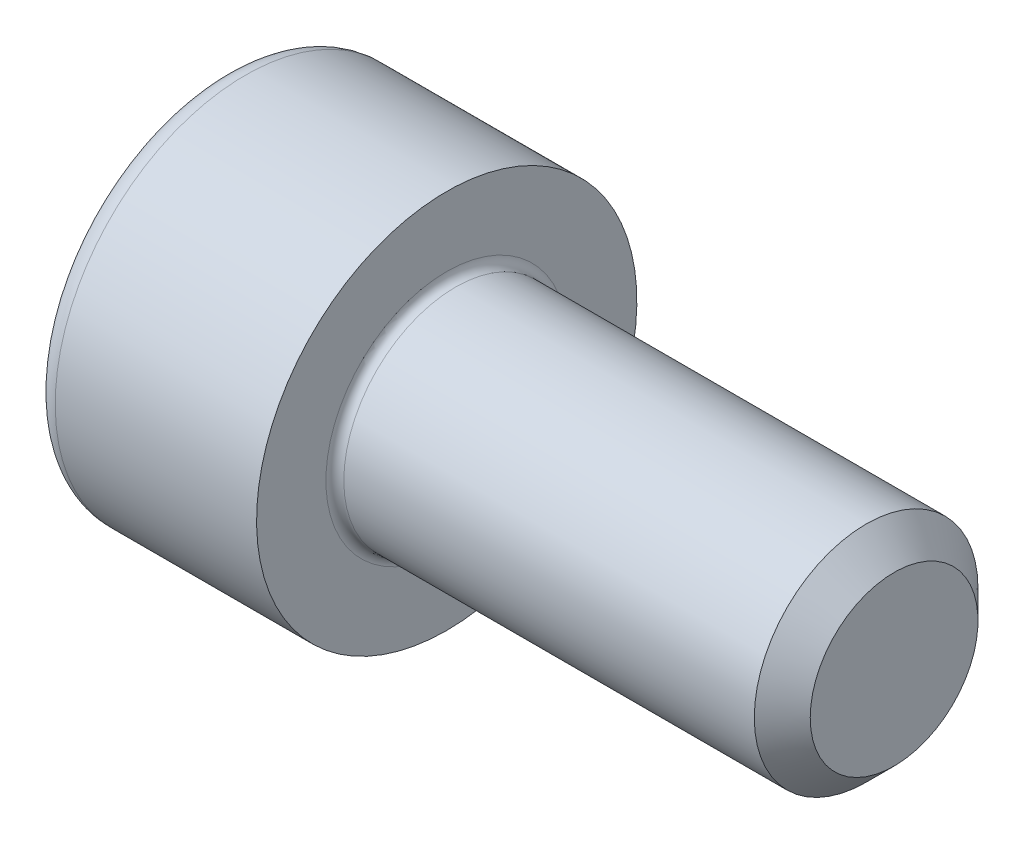
ISO-10303-21;
HEADER;
FILE_DESCRIPTION(('STEP AP214'),'2;1');
FILE_NAME('part.step','',(''),(''),'','','');
FILE_SCHEMA(('AUTOMOTIVE_DESIGN { 1 0 10303 214 1 1 1 1 }'));
ENDSEC;
DATA;
#1=APPLICATION_CONTEXT('core data for automotive mechanical design processes');
#2=APPLICATION_PROTOCOL_DEFINITION('international standard','automotive_design',2000,#1);
#3=PRODUCT_CONTEXT('',#1,'mechanical');
#4=PRODUCT('Part','Part','',(#3));
#5=PRODUCT_RELATED_PRODUCT_CATEGORY('part','',(#4));
#6=PRODUCT_DEFINITION_FORMATION('','',#4);
#7=PRODUCT_DEFINITION_CONTEXT('part definition',#1,'design');
#8=PRODUCT_DEFINITION('design','',#6,#7);
#9=PRODUCT_DEFINITION_SHAPE('','',#8);
#10=(LENGTH_UNIT() NAMED_UNIT(*) SI_UNIT(.MILLI.,.METRE.));
#11=(NAMED_UNIT(*) PLANE_ANGLE_UNIT() SI_UNIT($,.RADIAN.));
#12=(NAMED_UNIT(*) SI_UNIT($,.STERADIAN.) SOLID_ANGLE_UNIT());
#13=UNCERTAINTY_MEASURE_WITH_UNIT(LENGTH_MEASURE(1.E-05),#10,'distance_accuracy_value','');
#14=(GEOMETRIC_REPRESENTATION_CONTEXT(3) GLOBAL_UNCERTAINTY_ASSIGNED_CONTEXT((#13)) GLOBAL_UNIT_ASSIGNED_CONTEXT((#10,
#11,#12)) REPRESENTATION_CONTEXT('',''));
#15=CARTESIAN_POINT('',(0.,0.,0.));
#16=DIRECTION('',(0.,0.,1.));
#17=DIRECTION('',(1.,0.,0.));
#18=AXIS2_PLACEMENT_3D('',#15,#16,#17);
#19=CARTESIAN_POINT('',(-1.99999999995271,0.,0.));
#20=DIRECTION('',(-1.,0.,0.));
#21=DIRECTION('',(0.,0.,1.));
#22=AXIS2_PLACEMENT_3D('',#19,#20,#21);
#23=CONICAL_SURFACE('',#22,1.83319999985088,1.04719755109013);
#24=CARTESIAN_POINT('',(-0.941601486488253,-1.13686837721616E-10,0.));
#25=VERTEX_POINT('',#24);
#26=VERTEX_LOOP('',#25);
#27=FACE_BOUND('',#26,.T.);
#28=CARTESIAN_POINT('',(-2.00000000001834,0.,0.));
#29=DIRECTION('',(-1.,0.,0.));
#30=DIRECTION('',(0.,0.,1.));
#31=AXIS2_PLACEMENT_3D('',#28,#29,#30);
#32=CIRCLE('',#31,1.83319999996456);
#33=CARTESIAN_POINT('',(-2.00000000001834,-0.916599999982282,-1.58759777018694));
#34=VERTEX_POINT('',#33);
#35=CARTESIAN_POINT('',(-2.00000000001834,-1.83319999996456,0.));
#36=VERTEX_POINT('',#35);
#37=EDGE_CURVE('E89',#34,#36,#32,.T.);
#38=ORIENTED_EDGE('',*,*,#37,.T.);
#39=CARTESIAN_POINT('',(-2.00000000001834,0.,0.));
#40=DIRECTION('',(-1.,0.,0.));
#41=DIRECTION('',(0.,0.,1.));
#42=AXIS2_PLACEMENT_3D('',#39,#40,#41);
#43=CIRCLE('',#42,1.83319999996456);
#44=CARTESIAN_POINT('',(-2.00000000001834,-0.916599999982281,1.58759777018694));
#45=VERTEX_POINT('',#44);
#46=EDGE_CURVE('E84',#36,#45,#43,.T.);
#47=ORIENTED_EDGE('',*,*,#46,.T.);
#48=CARTESIAN_POINT('',(-2.00000000001834,0.,0.));
#49=DIRECTION('',(-1.,0.,0.));
#50=DIRECTION('',(0.,0.,1.));
#51=AXIS2_PLACEMENT_3D('',#48,#49,#50);
#52=CIRCLE('',#51,1.83319999996456);
#53=CARTESIAN_POINT('',(-1.99999999995271,0.916599999925436,1.58759777008849));
#54=VERTEX_POINT('',#53);
#55=EDGE_CURVE('E86',#45,#54,#52,.T.);
#56=ORIENTED_EDGE('',*,*,#55,.T.);
#57=CARTESIAN_POINT('',(-1.99999999995271,0.,0.));
#58=DIRECTION('',(-1.,0.,0.));
#59=DIRECTION('',(0.,0.,1.));
#60=AXIS2_PLACEMENT_3D('',#57,#58,#59);
#61=CIRCLE('',#60,1.83319999985088);
#62=CARTESIAN_POINT('',(-1.99999999995271,1.83319999985088,0.));
#63=VERTEX_POINT('',#62);
#64=EDGE_CURVE('E100',#54,#63,#61,.T.);
#65=ORIENTED_EDGE('',*,*,#64,.T.);
#66=CARTESIAN_POINT('',(-2.00000000001834,0.,0.));
#67=DIRECTION('',(-1.,0.,0.));
#68=DIRECTION('',(0.,0.,1.));
#69=AXIS2_PLACEMENT_3D('',#66,#67,#68);
#70=CIRCLE('',#69,1.83319999996456);
#71=CARTESIAN_POINT('',(-2.00000000001834,0.91659999998228,-1.58759777018694));
#72=VERTEX_POINT('',#71);
#73=EDGE_CURVE('E187',#63,#72,#70,.T.);
#74=ORIENTED_EDGE('',*,*,#73,.T.);
#75=CARTESIAN_POINT('',(-2.00000000001834,0.,0.));
#76=DIRECTION('',(-1.,0.,0.));
#77=DIRECTION('',(0.,0.,1.));
#78=AXIS2_PLACEMENT_3D('',#75,#76,#77);
#79=CIRCLE('',#78,1.83319999996456);
#80=EDGE_CURVE('E185',#72,#34,#79,.T.);
#81=ORIENTED_EDGE('',*,*,#80,.T.);
#82=EDGE_LOOP('',(#38,#47,#56,#65,#74,#81));
#83=FACE_BOUND('',#82,.T.);
#84=ADVANCED_FACE('F17',(#27,#83),#23,.F.);
#85=CARTESIAN_POINT('',(-2.,0.,0.));
#86=DIRECTION('',(-1.,0.,0.));
#87=DIRECTION('',(0.,-1.,0.));
#88=AXIS2_PLACEMENT_3D('',#85,#86,#87);
#89=PLANE('',#88);
#90=ORIENTED_EDGE('',*,*,#55,.F.);
#91=DIRECTION('',(0.,-1.,0.));
#92=VECTOR('',#91,1.);
#93=CARTESIAN_POINT('',(-2.,-0.9166,1.58759777021763));
#94=LINE('',#93,#92);
#95=EDGE_CURVE('E94',#45,#54,#94,.F.);
#96=ORIENTED_EDGE('',*,*,#95,.T.);
#97=EDGE_LOOP('',(#90,#96));
#98=FACE_BOUND('',#97,.T.);
#99=ADVANCED_FACE('F97',(#98),#89,.F.);
#100=CARTESIAN_POINT('',(-2.,0.,0.));
#101=DIRECTION('',(-1.,0.,0.));
#102=DIRECTION('',(0.,-1.,0.));
#103=AXIS2_PLACEMENT_3D('',#100,#101,#102);
#104=PLANE('',#103);
#105=ORIENTED_EDGE('',*,*,#64,.F.);
#106=DIRECTION('',(0.,-0.5,0.866025403784439));
#107=VECTOR('',#106,1.);
#108=CARTESIAN_POINT('',(-2.,0.9166,1.58759777021763));
#109=LINE('',#108,#107);
#110=EDGE_CURVE('E163',#54,#63,#109,.F.);
#111=ORIENTED_EDGE('',*,*,#110,.T.);
#112=EDGE_LOOP('',(#105,#111));
#113=FACE_BOUND('',#112,.T.);
#114=ADVANCED_FACE('F294',(#113),#104,.F.);
#115=CARTESIAN_POINT('',(-2.,0.,0.));
#116=DIRECTION('',(-1.,0.,0.));
#117=DIRECTION('',(0.,-1.,0.));
#118=AXIS2_PLACEMENT_3D('',#115,#116,#117);
#119=PLANE('',#118);
#120=ORIENTED_EDGE('',*,*,#73,.F.);
#121=DIRECTION('',(0.,0.5,0.866025403784439));
#122=VECTOR('',#121,1.);
#123=CARTESIAN_POINT('',(-2.,1.8332,0.));
#124=LINE('',#123,#122);
#125=EDGE_CURVE('E152',#63,#72,#124,.F.);
#126=ORIENTED_EDGE('',*,*,#125,.T.);
#127=EDGE_LOOP('',(#120,#126));
#128=FACE_BOUND('',#127,.T.);
#129=ADVANCED_FACE('F298',(#128),#119,.F.);
#130=CARTESIAN_POINT('',(-2.,0.,0.));
#131=DIRECTION('',(-1.,0.,0.));
#132=DIRECTION('',(0.,-1.,0.));
#133=AXIS2_PLACEMENT_3D('',#130,#131,#132);
#134=PLANE('',#133);
#135=ORIENTED_EDGE('',*,*,#80,.F.);
#136=DIRECTION('',(0.,1.,0.));
#137=VECTOR('',#136,1.);
#138=CARTESIAN_POINT('',(-2.,0.9166,-1.58759777021763));
#139=LINE('',#138,#137);
#140=EDGE_CURVE('E140',#72,#34,#139,.F.);
#141=ORIENTED_EDGE('',*,*,#140,.T.);
#142=EDGE_LOOP('',(#135,#141));
#143=FACE_BOUND('',#142,.T.);
#144=ADVANCED_FACE('F305',(#143),#134,.F.);
#145=CARTESIAN_POINT('',(-2.,0.,0.));
#146=DIRECTION('',(-1.,0.,0.));
#147=DIRECTION('',(0.,-1.,0.));
#148=AXIS2_PLACEMENT_3D('',#145,#146,#147);
#149=PLANE('',#148);
#150=ORIENTED_EDGE('',*,*,#37,.F.);
#151=DIRECTION('',(0.,0.5,-0.866025403784438));
#152=VECTOR('',#151,1.);
#153=CARTESIAN_POINT('',(-2.,-0.9166,-1.58759777021763));
#154=LINE('',#153,#152);
#155=EDGE_CURVE('E126',#34,#36,#154,.F.);
#156=ORIENTED_EDGE('',*,*,#155,.T.);
#157=EDGE_LOOP('',(#150,#156));
#158=FACE_BOUND('',#157,.T.);
#159=ADVANCED_FACE('F308',(#158),#149,.F.);
#160=CARTESIAN_POINT('',(-2.,0.,0.));
#161=DIRECTION('',(-1.,0.,0.));
#162=DIRECTION('',(0.,-1.,0.));
#163=AXIS2_PLACEMENT_3D('',#160,#161,#162);
#164=PLANE('',#163);
#165=ORIENTED_EDGE('',*,*,#46,.F.);
#166=DIRECTION('',(0.,-0.5,-0.866025403784438));
#167=VECTOR('',#166,1.);
#168=CARTESIAN_POINT('',(-2.,-1.8332,0.));
#169=LINE('',#168,#167);
#170=EDGE_CURVE('E102',#36,#45,#169,.F.);
#171=ORIENTED_EDGE('',*,*,#170,.T.);
#172=EDGE_LOOP('',(#165,#171));
#173=FACE_BOUND('',#172,.T.);
#174=ADVANCED_FACE('F103',(#173),#164,.F.);
#175=CARTESIAN_POINT('',(-2.,-0.9166,1.58759777021763));
#176=DIRECTION('',(0.,0.,1.));
#177=DIRECTION('',(0.,-1.,0.));
#178=AXIS2_PLACEMENT_3D('',#175,#176,#177);
#179=PLANE('',#178);
#180=DIRECTION('',(1.,0.,0.));
#181=VECTOR('',#180,1.);
#182=CARTESIAN_POINT('',(-2.,0.9166,1.58759777021763));
#183=LINE('',#182,#181);
#184=CARTESIAN_POINT('',(-4.,0.916599999999999,1.58759777021763));
#185=VERTEX_POINT('',#184);
#186=EDGE_CURVE('E114',#185,#54,#183,.T.);
#187=ORIENTED_EDGE('',*,*,#186,.T.);
#188=ORIENTED_EDGE('',*,*,#95,.F.);
#189=DIRECTION('',(1.,0.,0.));
#190=VECTOR('',#189,1.);
#191=CARTESIAN_POINT('',(-2.,-0.9166,1.58759777021763));
#192=LINE('',#191,#190);
#193=CARTESIAN_POINT('',(-4.,-0.9166,1.58759777021763));
#194=VERTEX_POINT('',#193);
#195=EDGE_CURVE('E107',#45,#194,#192,.F.);
#196=ORIENTED_EDGE('',*,*,#195,.T.);
#197=DIRECTION('',(0.,1.,0.));
#198=VECTOR('',#197,1.);
#199=CARTESIAN_POINT('',(-4.,1.8332,1.58759777021763));
#200=LINE('',#199,#198);
#201=EDGE_CURVE('E121',#194,#185,#200,.T.);
#202=ORIENTED_EDGE('',*,*,#201,.T.);
#203=EDGE_LOOP('',(#187,#188,#196,#202));
#204=FACE_BOUND('',#203,.T.);
#205=ADVANCED_FACE('F111',(#204),#179,.F.);
#206=CARTESIAN_POINT('',(-2.,0.9166,1.58759777021763));
#207=DIRECTION('',(0.,0.866025403784439,0.5));
#208=DIRECTION('',(0.,-0.5,0.866025403784439));
#209=AXIS2_PLACEMENT_3D('',#206,#207,#208);
#210=PLANE('',#209);
#211=DIRECTION('',(1.,0.,0.));
#212=VECTOR('',#211,1.);
#213=CARTESIAN_POINT('',(-2.,1.8332,0.));
#214=LINE('',#213,#212);
#215=CARTESIAN_POINT('',(-4.,1.8332,0.));
#216=VERTEX_POINT('',#215);
#217=EDGE_CURVE('E157',#216,#63,#214,.T.);
#218=ORIENTED_EDGE('',*,*,#217,.T.);
#219=ORIENTED_EDGE('',*,*,#110,.F.);
#220=ORIENTED_EDGE('',*,*,#186,.F.);
#221=DIRECTION('',(0.,0.500000000000001,-0.866025403784438));
#222=VECTOR('',#221,1.);
#223=CARTESIAN_POINT('',(-4.,0.9166,1.58759777021763));
#224=LINE('',#223,#222);
#225=EDGE_CURVE('E123',#185,#216,#224,.T.);
#226=ORIENTED_EDGE('',*,*,#225,.T.);
#227=EDGE_LOOP('',(#218,#219,#220,#226));
#228=FACE_BOUND('',#227,.T.);
#229=ADVANCED_FACE('F290',(#228),#210,.F.);
#230=CARTESIAN_POINT('',(-2.,1.8332,0.));
#231=DIRECTION('',(0.,0.866025403784439,-0.5));
#232=DIRECTION('',(0.,0.5,0.866025403784439));
#233=AXIS2_PLACEMENT_3D('',#230,#231,#232);
#234=PLANE('',#233);
#235=DIRECTION('',(1.,0.,0.));
#236=VECTOR('',#235,1.);
#237=CARTESIAN_POINT('',(-2.,0.9166,-1.58759777021763));
#238=LINE('',#237,#236);
#239=CARTESIAN_POINT('',(-4.,0.9166,-1.58759777021763));
#240=VERTEX_POINT('',#239);
#241=EDGE_CURVE('E145',#240,#72,#238,.T.);
#242=ORIENTED_EDGE('',*,*,#241,.T.);
#243=ORIENTED_EDGE('',*,*,#125,.F.);
#244=ORIENTED_EDGE('',*,*,#217,.F.);
#245=DIRECTION('',(0.,-0.499999999999999,-0.866025403784439));
#246=VECTOR('',#245,1.);
#247=CARTESIAN_POINT('',(-4.,1.8332,0.));
#248=LINE('',#247,#246);
#249=EDGE_CURVE('E147',#216,#240,#248,.T.);
#250=ORIENTED_EDGE('',*,*,#249,.T.);
#251=EDGE_LOOP('',(#242,#243,#244,#250));
#252=FACE_BOUND('',#251,.T.);
#253=ADVANCED_FACE('F301',(#252),#234,.F.);
#254=CARTESIAN_POINT('',(-2.,0.9166,-1.58759777021763));
#255=DIRECTION('',(0.,0.,-1.));
#256=DIRECTION('',(0.,1.,0.));
#257=AXIS2_PLACEMENT_3D('',#254,#255,#256);
#258=PLANE('',#257);
#259=DIRECTION('',(1.,0.,0.));
#260=VECTOR('',#259,1.);
#261=CARTESIAN_POINT('',(-2.,-0.9166,-1.58759777021763));
#262=LINE('',#261,#260);
#263=CARTESIAN_POINT('',(-4.,-0.9166,-1.58759777021763));
#264=VERTEX_POINT('',#263);
#265=EDGE_CURVE('E128',#264,#34,#262,.T.);
#266=ORIENTED_EDGE('',*,*,#265,.T.);
#267=ORIENTED_EDGE('',*,*,#140,.F.);
#268=ORIENTED_EDGE('',*,*,#241,.F.);
#269=DIRECTION('',(0.,1.,0.));
#270=VECTOR('',#269,1.);
#271=CARTESIAN_POINT('',(-4.,1.8332,-1.58759777021763));
#272=LINE('',#271,#270);
#273=EDGE_CURVE('E131',#240,#264,#272,.F.);
#274=ORIENTED_EDGE('',*,*,#273,.T.);
#275=EDGE_LOOP('',(#266,#267,#268,#274));
#276=FACE_BOUND('',#275,.T.);
#277=ADVANCED_FACE('F306',(#276),#258,.F.);
#278=CARTESIAN_POINT('',(-2.,-0.9166,-1.58759777021763));
#279=DIRECTION('',(0.,-0.866025403784438,-0.5));
#280=DIRECTION('',(0.,0.5,-0.866025403784438));
#281=AXIS2_PLACEMENT_3D('',#278,#279,#280);
#282=PLANE('',#281);
#283=DIRECTION('',(1.,0.,0.));
#284=VECTOR('',#283,1.);
#285=CARTESIAN_POINT('',(-2.,-1.8332,0.));
#286=LINE('',#285,#284);
#287=CARTESIAN_POINT('',(-4.,-1.8332,0.));
#288=VERTEX_POINT('',#287);
#289=EDGE_CURVE('E108',#288,#36,#286,.T.);
#290=ORIENTED_EDGE('',*,*,#289,.T.);
#291=ORIENTED_EDGE('',*,*,#155,.F.);
#292=ORIENTED_EDGE('',*,*,#265,.F.);
#293=DIRECTION('',(0.,-0.5,0.866025403784439));
#294=VECTOR('',#293,1.);
#295=CARTESIAN_POINT('',(-4.,-0.9166,-1.58759777021763));
#296=LINE('',#295,#294);
#297=EDGE_CURVE('E129',#264,#288,#296,.T.);
#298=ORIENTED_EDGE('',*,*,#297,.T.);
#299=EDGE_LOOP('',(#290,#291,#292,#298));
#300=FACE_BOUND('',#299,.T.);
#301=ADVANCED_FACE('F281',(#300),#282,.F.);
#302=CARTESIAN_POINT('',(-2.,-1.8332,0.));
#303=DIRECTION('',(0.,-0.866025403784438,0.5));
#304=DIRECTION('',(0.,-0.5,-0.866025403784438));
#305=AXIS2_PLACEMENT_3D('',#302,#303,#304);
#306=PLANE('',#305);
#307=ORIENTED_EDGE('',*,*,#195,.F.);
#308=ORIENTED_EDGE('',*,*,#170,.F.);
#309=ORIENTED_EDGE('',*,*,#289,.F.);
#310=DIRECTION('',(0.,0.5,0.866025403784439));
#311=VECTOR('',#310,1.);
#312=CARTESIAN_POINT('',(-4.,-1.8332,0.));
#313=LINE('',#312,#311);
#314=EDGE_CURVE('E119',#288,#194,#313,.T.);
#315=ORIENTED_EDGE('',*,*,#314,.T.);
#316=EDGE_LOOP('',(#307,#308,#309,#315));
#317=FACE_BOUND('',#316,.T.);
#318=ADVANCED_FACE('F117',(#317),#306,.F.);
#319=CARTESIAN_POINT('',(-4.,1.8332,0.));
#320=DIRECTION('',(1.,0.,0.));
#321=DIRECTION('',(0.,1.,0.));
#322=AXIS2_PLACEMENT_3D('',#319,#320,#321);
#323=PLANE('',#322);
#324=CARTESIAN_POINT('',(-4.,0.,0.));
#325=DIRECTION('',(1.,0.,0.));
#326=DIRECTION('',(0.,-1.,0.));
#327=AXIS2_PLACEMENT_3D('',#324,#325,#326);
#328=CIRCLE('',#327,3.);
#329=CARTESIAN_POINT('',(-4.,-3.,0.));
#330=VERTEX_POINT('',#329);
#331=CARTESIAN_POINT('',(-4.,3.,0.));
#332=VERTEX_POINT('',#331);
#333=EDGE_CURVE('E135',#330,#332,#328,.T.);
#334=ORIENTED_EDGE('',*,*,#333,.F.);
#335=CARTESIAN_POINT('',(-4.,0.,0.));
#336=DIRECTION('',(1.,0.,0.));
#337=DIRECTION('',(0.,1.,0.));
#338=AXIS2_PLACEMENT_3D('',#335,#336,#337);
#339=CIRCLE('',#338,3.);
#340=EDGE_CURVE('E250',#332,#330,#339,.T.);
#341=ORIENTED_EDGE('',*,*,#340,.F.);
#342=EDGE_LOOP('',(#334,#341));
#343=FACE_BOUND('',#342,.T.);
#344=ORIENTED_EDGE('',*,*,#297,.F.);
#345=ORIENTED_EDGE('',*,*,#273,.F.);
#346=ORIENTED_EDGE('',*,*,#249,.F.);
#347=ORIENTED_EDGE('',*,*,#225,.F.);
#348=ORIENTED_EDGE('',*,*,#201,.F.);
#349=ORIENTED_EDGE('',*,*,#314,.F.);
#350=EDGE_LOOP('',(#344,#345,#346,#347,#348,#349));
#351=FACE_BOUND('',#350,.T.);
#352=ADVANCED_FACE('F259',(#343,#351),#323,.F.);
#353=CARTESIAN_POINT('',(-3.6,0.,0.));
#354=DIRECTION('',(-1.,0.,0.));
#355=DIRECTION('',(0.,1.,0.));
#356=AXIS2_PLACEMENT_3D('',#353,#354,#355);
#357=TOROIDAL_SURFACE('',#356,3.,0.4);
#358=ORIENTED_EDGE('',*,*,#333,.T.);
#359=ORIENTED_EDGE('',*,*,#340,.T.);
#360=EDGE_LOOP('',(#358,#359));
#361=FACE_BOUND('',#360,.T.);
#362=CARTESIAN_POINT('',(-3.6,0.,0.));
#363=DIRECTION('',(-1.,0.,0.));
#364=DIRECTION('',(0.,-1.,0.));
#365=AXIS2_PLACEMENT_3D('',#362,#363,#364);
#366=CIRCLE('',#365,3.4);
#367=CARTESIAN_POINT('',(-3.6,-3.4,0.));
#368=VERTEX_POINT('',#367);
#369=EDGE_CURVE('E182',#368,#368,#366,.F.);
#370=ORIENTED_EDGE('',*,*,#369,.F.);
#371=EDGE_LOOP('',(#370));
#372=FACE_BOUND('',#371,.T.);
#373=ADVANCED_FACE('F254',(#361,#372),#357,.T.);
#374=CARTESIAN_POINT('',(-0.94160148652158,0.,0.));
#375=DIRECTION('',(-1.,0.,0.));
#376=DIRECTION('',(0.,-1.,0.));
#377=AXIS2_PLACEMENT_3D('',#374,#375,#376);
#378=CYLINDRICAL_SURFACE('',#377,3.4);
#379=ORIENTED_EDGE('',*,*,#369,.T.);
#380=EDGE_LOOP('',(#379));
#381=FACE_BOUND('',#380,.T.);
#382=CARTESIAN_POINT('',(0.,0.,0.));
#383=DIRECTION('',(-1.,0.,0.));
#384=DIRECTION('',(0.,-1.,0.));
#385=AXIS2_PLACEMENT_3D('',#382,#383,#384);
#386=CIRCLE('',#385,3.4);
#387=CARTESIAN_POINT('',(0.,-3.4,0.));
#388=VERTEX_POINT('',#387);
#389=EDGE_CURVE('E180',#388,#388,#386,.T.);
#390=ORIENTED_EDGE('',*,*,#389,.T.);
#391=EDGE_LOOP('',(#390));
#392=FACE_BOUND('',#391,.T.);
#393=ADVANCED_FACE('F258',(#381,#392),#378,.T.);
#394=CARTESIAN_POINT('',(8.,0.,0.));
#395=DIRECTION('',(-1.,0.,0.));
#396=DIRECTION('',(0.,0.,1.));
#397=AXIS2_PLACEMENT_3D('',#394,#395,#396);
#398=PLANE('',#397);
#399=CARTESIAN_POINT('',(8.0000000000382,0.,0.));
#400=DIRECTION('',(-1.,0.,0.));
#401=DIRECTION('',(0.,0.,1.));
#402=AXIS2_PLACEMENT_3D('',#399,#400,#401);
#403=CIRCLE('',#402,1.49999999990769);
#404=CARTESIAN_POINT('',(8.0000000000382,0.,1.49999999990769));
#405=VERTEX_POINT('',#404);
#406=EDGE_CURVE('E176',#405,#405,#403,.T.);
#407=ORIENTED_EDGE('',*,*,#406,.F.);
#408=EDGE_LOOP('',(#407));
#409=FACE_BOUND('',#408,.T.);
#410=ADVANCED_FACE('F227',(#409),#398,.F.);
#411=CARTESIAN_POINT('',(0.,3.4,0.));
#412=DIRECTION('',(-1.,0.,0.));
#413=DIRECTION('',(0.,-1.,0.));
#414=AXIS2_PLACEMENT_3D('',#411,#412,#413);
#415=PLANE('',#414);
#416=CARTESIAN_POINT('',(0.,0.,0.));
#417=DIRECTION('',(1.,0.,0.));
#418=DIRECTION('',(0.,-1.,0.));
#419=AXIS2_PLACEMENT_3D('',#416,#417,#418);
#420=CIRCLE('',#419,2.16);
#421=CARTESIAN_POINT('',(0.,2.16,0.));
#422=VERTEX_POINT('',#421);
#423=CARTESIAN_POINT('',(0.,-2.16,0.));
#424=VERTEX_POINT('',#423);
#425=EDGE_CURVE('E179',#422,#424,#420,.F.);
#426=ORIENTED_EDGE('',*,*,#425,.T.);
#427=CARTESIAN_POINT('',(0.,0.,0.));
#428=DIRECTION('',(1.,0.,0.));
#429=DIRECTION('',(0.,1.,0.));
#430=AXIS2_PLACEMENT_3D('',#427,#428,#429);
#431=CIRCLE('',#430,2.16);
#432=EDGE_CURVE('E36',#424,#422,#431,.F.);
#433=ORIENTED_EDGE('',*,*,#432,.T.);
#434=EDGE_LOOP('',(#426,#433));
#435=FACE_BOUND('',#434,.T.);
#436=ORIENTED_EDGE('',*,*,#389,.F.);
#437=EDGE_LOOP('',(#436));
#438=FACE_BOUND('',#437,.T.);
#439=ADVANCED_FACE('F218',(#435,#438),#415,.F.);
#440=CARTESIAN_POINT('',(7.49999999999318,0.,0.));
#441=DIRECTION('',(-1.,0.,0.));
#442=DIRECTION('',(0.,0.,1.));
#443=AXIS2_PLACEMENT_3D('',#440,#441,#442);
#444=CONICAL_SURFACE('',#443,1.99999999995271,0.785398163397448);
#445=ORIENTED_EDGE('',*,*,#406,.T.);
#446=EDGE_LOOP('',(#445));
#447=FACE_BOUND('',#446,.T.);
#448=CARTESIAN_POINT('',(7.5,0.,0.));
#449=DIRECTION('',(-1.,0.,0.));
#450=DIRECTION('',(0.,-1.,0.));
#451=AXIS2_PLACEMENT_3D('',#448,#449,#450);
#452=CIRCLE('',#451,2.);
#453=CARTESIAN_POINT('',(7.5,-2.,0.));
#454=VERTEX_POINT('',#453);
#455=EDGE_CURVE('E28',#454,#454,#452,.T.);
#456=ORIENTED_EDGE('',*,*,#455,.F.);
#457=EDGE_LOOP('',(#456));
#458=FACE_BOUND('',#457,.T.);
#459=ADVANCED_FACE('F207',(#447,#458),#444,.T.);
#460=CARTESIAN_POINT('',(0.16,0.,0.));
#461=DIRECTION('',(-1.,0.,0.));
#462=DIRECTION('',(0.,1.,0.));
#463=AXIS2_PLACEMENT_3D('',#460,#461,#462);
#464=TOROIDAL_SURFACE('',#463,2.16,0.16);
#465=CARTESIAN_POINT('',(0.16,0.,0.));
#466=DIRECTION('',(-1.,0.,0.));
#467=DIRECTION('',(0.,-1.,0.));
#468=AXIS2_PLACEMENT_3D('',#465,#466,#467);
#469=CIRCLE('',#468,2.);
#470=CARTESIAN_POINT('',(0.16,-2.,0.));
#471=VERTEX_POINT('',#470);
#472=EDGE_CURVE('E10',#471,#471,#469,.F.);
#473=ORIENTED_EDGE('',*,*,#472,.F.);
#474=EDGE_LOOP('',(#473));
#475=FACE_BOUND('',#474,.T.);
#476=ORIENTED_EDGE('',*,*,#425,.F.);
#477=ORIENTED_EDGE('',*,*,#432,.F.);
#478=EDGE_LOOP('',(#476,#477));
#479=FACE_BOUND('',#478,.T.);
#480=ADVANCED_FACE('F195',(#475,#479),#464,.F.);
#481=CARTESIAN_POINT('',(-0.94160148652158,0.,0.));
#482=DIRECTION('',(-1.,0.,0.));
#483=DIRECTION('',(0.,-1.,0.));
#484=AXIS2_PLACEMENT_3D('',#481,#482,#483);
#485=CYLINDRICAL_SURFACE('',#484,2.);
#486=ORIENTED_EDGE('',*,*,#472,.T.);
#487=EDGE_LOOP('',(#486));
#488=FACE_BOUND('',#487,.T.);
#489=ORIENTED_EDGE('',*,*,#455,.T.);
#490=EDGE_LOOP('',(#489));
#491=FACE_BOUND('',#490,.T.);
#492=ADVANCED_FACE('F206',(#488,#491),#485,.T.);
#493=CLOSED_SHELL('',(#84,#99,#114,#129,#144,#159,#174,#205,#229,#253,#277,#301,#318,#352,#373,
#393,#410,#439,#459,#480,#492));
#494=MANIFOLD_SOLID_BREP('B1',#493);
#495=ADVANCED_BREP_SHAPE_REPRESENTATION('',(#18,#494),#14);
#496=SHAPE_DEFINITION_REPRESENTATION(#9,#495);
ENDSEC;
END-ISO-10303-21;
